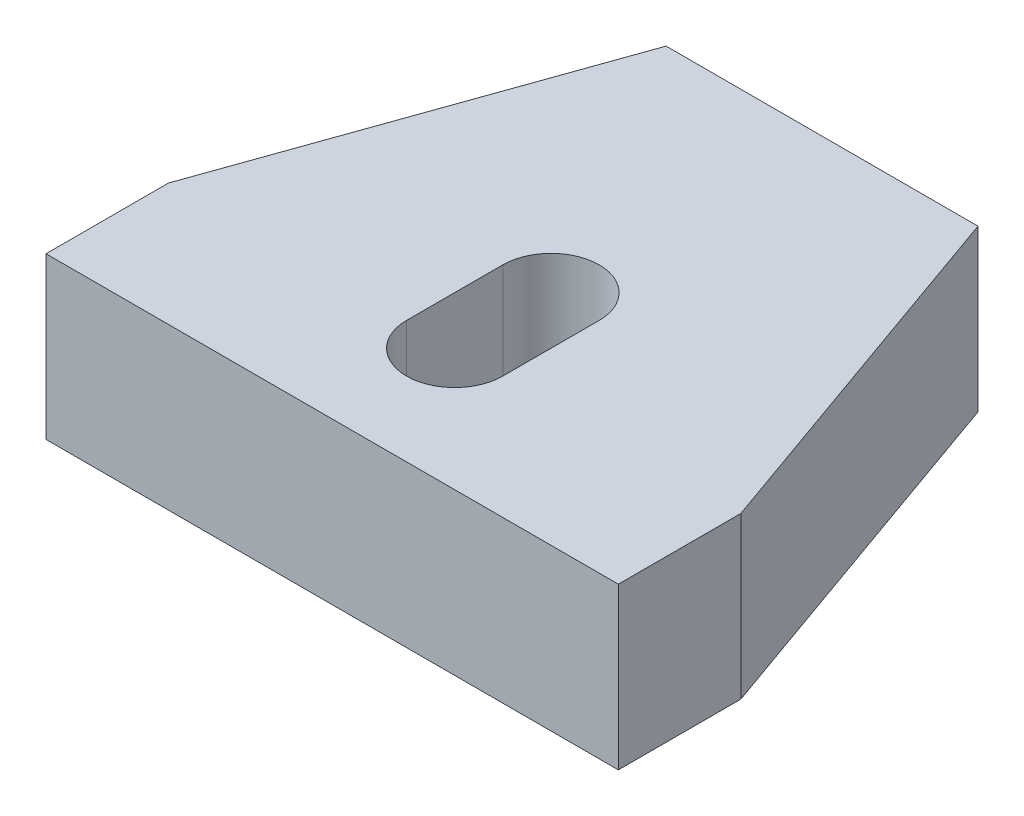
ISO-10303-21;
HEADER;
FILE_DESCRIPTION(('STEP AP214'),'2;1');
FILE_NAME('part.step','',(''),(''),'','','');
FILE_SCHEMA(('AUTOMOTIVE_DESIGN { 1 0 10303 214 1 1 1 1 }'));
ENDSEC;
DATA;
#1=APPLICATION_CONTEXT('core data for automotive mechanical design processes');
#2=APPLICATION_PROTOCOL_DEFINITION('international standard','automotive_design',2000,#1);
#3=PRODUCT_CONTEXT('',#1,'mechanical');
#4=PRODUCT('Part','Part','',(#3));
#5=PRODUCT_RELATED_PRODUCT_CATEGORY('part','',(#4));
#6=PRODUCT_DEFINITION_FORMATION('','',#4);
#7=PRODUCT_DEFINITION_CONTEXT('part definition',#1,'design');
#8=PRODUCT_DEFINITION('design','',#6,#7);
#9=PRODUCT_DEFINITION_SHAPE('','',#8);
#10=(LENGTH_UNIT() NAMED_UNIT(*) SI_UNIT(.MILLI.,.METRE.));
#11=(NAMED_UNIT(*) PLANE_ANGLE_UNIT() SI_UNIT($,.RADIAN.));
#12=(NAMED_UNIT(*) SI_UNIT($,.STERADIAN.) SOLID_ANGLE_UNIT());
#13=UNCERTAINTY_MEASURE_WITH_UNIT(LENGTH_MEASURE(1.E-05),#10,'distance_accuracy_value','');
#14=(GEOMETRIC_REPRESENTATION_CONTEXT(3) GLOBAL_UNCERTAINTY_ASSIGNED_CONTEXT((#13)) GLOBAL_UNIT_ASSIGNED_CONTEXT((#10,
#11,#12)) REPRESENTATION_CONTEXT('',''));
#15=CARTESIAN_POINT('',(0.,0.,0.));
#16=DIRECTION('',(0.,0.,1.));
#17=DIRECTION('',(1.,0.,0.));
#18=AXIS2_PLACEMENT_3D('',#15,#16,#17);
#19=CARTESIAN_POINT('',(0.,5.0038,0.));
#20=DIRECTION('',(0.,1.,0.));
#21=DIRECTION('',(0.,0.,1.));
#22=AXIS2_PLACEMENT_3D('',#19,#20,#21);
#23=PLANE('',#22);
#24=DIRECTION('',(-0.334079769437549,0.,0.942544804055783));
#25=VECTOR('',#24,1.);
#26=CARTESIAN_POINT('',(-4.8514,5.0038,-15.24));
#27=LINE('',#26,#25);
#28=CARTESIAN_POINT('',(-4.8514,5.0038,-15.24));
#29=VERTEX_POINT('',#28);
#30=CARTESIAN_POINT('',(-8.9027,5.0038,-3.81));
#31=VERTEX_POINT('',#30);
#32=EDGE_CURVE('E145',#29,#31,#27,.T.);
#33=ORIENTED_EDGE('',*,*,#32,.T.);
#34=DIRECTION('',(0.,0.,1.));
#35=VECTOR('',#34,1.);
#36=CARTESIAN_POINT('',(-8.9027,5.0038,0.));
#37=LINE('',#36,#35);
#38=CARTESIAN_POINT('',(-8.9027,5.0038,0.));
#39=VERTEX_POINT('',#38);
#40=EDGE_CURVE('E148',#31,#39,#37,.T.);
#41=ORIENTED_EDGE('',*,*,#40,.T.);
#42=DIRECTION('',(1.,0.,0.));
#43=VECTOR('',#42,1.);
#44=CARTESIAN_POINT('',(-8.9027,5.0038,0.));
#45=LINE('',#44,#43);
#46=CARTESIAN_POINT('',(8.9027,5.0038,0.));
#47=VERTEX_POINT('',#46);
#48=EDGE_CURVE('E151',#39,#47,#45,.T.);
#49=ORIENTED_EDGE('',*,*,#48,.T.);
#50=DIRECTION('',(0.,0.,-1.));
#51=VECTOR('',#50,1.);
#52=CARTESIAN_POINT('',(8.9027,5.0038,0.));
#53=LINE('',#52,#51);
#54=CARTESIAN_POINT('',(8.9027,5.0038,-3.81));
#55=VERTEX_POINT('',#54);
#56=EDGE_CURVE('E153',#47,#55,#53,.T.);
#57=ORIENTED_EDGE('',*,*,#56,.T.);
#58=DIRECTION('',(-0.33407976943755,0.,-0.942544804055783));
#59=VECTOR('',#58,1.);
#60=CARTESIAN_POINT('',(8.9027,5.0038,-3.81));
#61=LINE('',#60,#59);
#62=CARTESIAN_POINT('',(4.8514,5.0038,-15.24));
#63=VERTEX_POINT('',#62);
#64=EDGE_CURVE('E155',#55,#63,#61,.T.);
#65=ORIENTED_EDGE('',*,*,#64,.T.);
#66=DIRECTION('',(-1.,0.,0.));
#67=VECTOR('',#66,1.);
#68=CARTESIAN_POINT('',(-4.8514,5.0038,-15.24));
#69=LINE('',#68,#67);
#70=EDGE_CURVE('E157',#63,#29,#69,.T.);
#71=ORIENTED_EDGE('',*,*,#70,.T.);
#72=EDGE_LOOP('',(#33,#41,#49,#57,#65,#71));
#73=FACE_BOUND('',#72,.T.);
#74=DIRECTION('',(0.,0.,-1.));
#75=VECTOR('',#74,1.);
#76=CARTESIAN_POINT('',(1.4986,5.0038,-3.81));
#77=LINE('',#76,#75);
#78=CARTESIAN_POINT('',(1.4986,5.0038,-3.81));
#79=VERTEX_POINT('',#78);
#80=CARTESIAN_POINT('',(1.4986,5.0038,-6.8072));
#81=VERTEX_POINT('',#80);
#82=EDGE_CURVE('E117',#79,#81,#77,.T.);
#83=ORIENTED_EDGE('',*,*,#82,.F.);
#84=CARTESIAN_POINT('',(0.,5.0038,-3.81));
#85=DIRECTION('',(0.,1.,0.));
#86=DIRECTION('',(0.,0.,1.));
#87=AXIS2_PLACEMENT_3D('',#84,#85,#86);
#88=CIRCLE('',#87,1.4986);
#89=CARTESIAN_POINT('',(-1.4986,5.0038,-3.81));
#90=VERTEX_POINT('',#89);
#91=EDGE_CURVE('E109',#90,#79,#88,.T.);
#92=ORIENTED_EDGE('',*,*,#91,.F.);
#93=DIRECTION('',(0.,0.,1.));
#94=VECTOR('',#93,1.);
#95=CARTESIAN_POINT('',(-1.4986,5.0038,-3.81));
#96=LINE('',#95,#94);
#97=CARTESIAN_POINT('',(-1.4986,5.0038,-6.8072));
#98=VERTEX_POINT('',#97);
#99=EDGE_CURVE('E131',#98,#90,#96,.T.);
#100=ORIENTED_EDGE('',*,*,#99,.F.);
#101=CARTESIAN_POINT('',(0.,5.0038,-6.8072));
#102=DIRECTION('',(0.,1.,0.));
#103=DIRECTION('',(0.,0.,1.));
#104=AXIS2_PLACEMENT_3D('',#101,#102,#103);
#105=CIRCLE('',#104,1.4986);
#106=EDGE_CURVE('E129',#81,#98,#105,.T.);
#107=ORIENTED_EDGE('',*,*,#106,.F.);
#108=EDGE_LOOP('',(#83,#92,#100,#107));
#109=FACE_BOUND('',#108,.T.);
#110=ADVANCED_FACE('F32',(#73,#109),#23,.T.);
#111=CARTESIAN_POINT('',(0.,0.,0.));
#112=DIRECTION('',(0.,1.,0.));
#113=DIRECTION('',(0.,0.,1.));
#114=AXIS2_PLACEMENT_3D('',#111,#112,#113);
#115=PLANE('',#114);
#116=DIRECTION('',(-0.334079769437549,0.,0.942544804055783));
#117=VECTOR('',#116,1.);
#118=CARTESIAN_POINT('',(-4.8514,0.,-15.24));
#119=LINE('',#118,#117);
#120=CARTESIAN_POINT('',(-4.8514,0.,-15.24));
#121=VERTEX_POINT('',#120);
#122=CARTESIAN_POINT('',(-8.9027,0.,-3.81));
#123=VERTEX_POINT('',#122);
#124=EDGE_CURVE('E125',#121,#123,#119,.T.);
#125=ORIENTED_EDGE('',*,*,#124,.F.);
#126=DIRECTION('',(-1.,0.,0.));
#127=VECTOR('',#126,1.);
#128=CARTESIAN_POINT('',(-4.8514,0.,-15.24));
#129=LINE('',#128,#127);
#130=CARTESIAN_POINT('',(4.8514,0.,-15.24));
#131=VERTEX_POINT('',#130);
#132=EDGE_CURVE('E149',#131,#121,#129,.T.);
#133=ORIENTED_EDGE('',*,*,#132,.F.);
#134=DIRECTION('',(-0.33407976943755,0.,-0.942544804055783));
#135=VECTOR('',#134,1.);
#136=CARTESIAN_POINT('',(8.9027,0.,-3.81));
#137=LINE('',#136,#135);
#138=CARTESIAN_POINT('',(8.9027,0.,-3.81));
#139=VERTEX_POINT('',#138);
#140=EDGE_CURVE('E168',#139,#131,#137,.T.);
#141=ORIENTED_EDGE('',*,*,#140,.F.);
#142=DIRECTION('',(0.,0.,-1.));
#143=VECTOR('',#142,1.);
#144=CARTESIAN_POINT('',(8.9027,0.,0.));
#145=LINE('',#144,#143);
#146=CARTESIAN_POINT('',(8.9027,0.,0.));
#147=VERTEX_POINT('',#146);
#148=EDGE_CURVE('E166',#147,#139,#145,.T.);
#149=ORIENTED_EDGE('',*,*,#148,.F.);
#150=DIRECTION('',(1.,0.,0.));
#151=VECTOR('',#150,1.);
#152=CARTESIAN_POINT('',(-8.9027,0.,0.));
#153=LINE('',#152,#151);
#154=CARTESIAN_POINT('',(-8.9027,0.,0.));
#155=VERTEX_POINT('',#154);
#156=EDGE_CURVE('E164',#155,#147,#153,.T.);
#157=ORIENTED_EDGE('',*,*,#156,.F.);
#158=DIRECTION('',(0.,0.,1.));
#159=VECTOR('',#158,1.);
#160=CARTESIAN_POINT('',(-8.9027,0.,0.));
#161=LINE('',#160,#159);
#162=EDGE_CURVE('E162',#123,#155,#161,.T.);
#163=ORIENTED_EDGE('',*,*,#162,.F.);
#164=EDGE_LOOP('',(#125,#133,#141,#149,#157,#163));
#165=FACE_BOUND('',#164,.T.);
#166=CARTESIAN_POINT('',(0.,0.,-3.81));
#167=DIRECTION('',(0.,1.,0.));
#168=DIRECTION('',(0.,0.,1.));
#169=AXIS2_PLACEMENT_3D('',#166,#167,#168);
#170=CIRCLE('',#169,1.4986);
#171=CARTESIAN_POINT('',(-1.4986,0.,-3.81));
#172=VERTEX_POINT('',#171);
#173=CARTESIAN_POINT('',(1.4986,0.,-3.81));
#174=VERTEX_POINT('',#173);
#175=EDGE_CURVE('E55',#172,#174,#170,.T.);
#176=ORIENTED_EDGE('',*,*,#175,.T.);
#177=DIRECTION('',(0.,0.,-1.));
#178=VECTOR('',#177,1.);
#179=CARTESIAN_POINT('',(1.4986,0.,-3.81));
#180=LINE('',#179,#178);
#181=CARTESIAN_POINT('',(1.4986,0.,-6.8072));
#182=VERTEX_POINT('',#181);
#183=EDGE_CURVE('E124',#174,#182,#180,.T.);
#184=ORIENTED_EDGE('',*,*,#183,.T.);
#185=CARTESIAN_POINT('',(0.,0.,-6.8072));
#186=DIRECTION('',(0.,1.,0.));
#187=DIRECTION('',(0.,0.,1.));
#188=AXIS2_PLACEMENT_3D('',#185,#186,#187);
#189=CIRCLE('',#188,1.4986);
#190=CARTESIAN_POINT('',(-1.4986,0.,-6.8072));
#191=VERTEX_POINT('',#190);
#192=EDGE_CURVE('E137',#182,#191,#189,.T.);
#193=ORIENTED_EDGE('',*,*,#192,.T.);
#194=DIRECTION('',(0.,0.,1.));
#195=VECTOR('',#194,1.);
#196=CARTESIAN_POINT('',(-1.4986,0.,-3.81));
#197=LINE('',#196,#195);
#198=EDGE_CURVE('E118',#191,#172,#197,.T.);
#199=ORIENTED_EDGE('',*,*,#198,.T.);
#200=EDGE_LOOP('',(#176,#184,#193,#199));
#201=FACE_BOUND('',#200,.T.);
#202=ADVANCED_FACE('F192',(#165,#201),#115,.F.);
#203=CARTESIAN_POINT('',(-4.8514,5.0038,-15.24));
#204=DIRECTION('',(0.942544804055783,0.,0.334079769437549));
#205=DIRECTION('',(0.334079769437549,0.,-0.942544804055783));
#206=AXIS2_PLACEMENT_3D('',#203,#204,#205);
#207=PLANE('',#206);
#208=ORIENTED_EDGE('',*,*,#124,.T.);
#209=DIRECTION('',(0.,-1.,0.));
#210=VECTOR('',#209,1.);
#211=CARTESIAN_POINT('',(-8.9027,5.0038,-3.81));
#212=LINE('',#211,#210);
#213=EDGE_CURVE('E11',#31,#123,#212,.T.);
#214=ORIENTED_EDGE('',*,*,#213,.F.);
#215=ORIENTED_EDGE('',*,*,#32,.F.);
#216=DIRECTION('',(0.,-1.,0.));
#217=VECTOR('',#216,1.);
#218=CARTESIAN_POINT('',(-4.8514,5.0038,-15.24));
#219=LINE('',#218,#217);
#220=EDGE_CURVE('E159',#29,#121,#219,.T.);
#221=ORIENTED_EDGE('',*,*,#220,.T.);
#222=EDGE_LOOP('',(#208,#214,#215,#221));
#223=FACE_BOUND('',#222,.T.);
#224=ADVANCED_FACE('F34',(#223),#207,.F.);
#225=CARTESIAN_POINT('',(-8.9027,5.0038,0.));
#226=DIRECTION('',(1.,0.,0.));
#227=DIRECTION('',(0.,0.,-1.));
#228=AXIS2_PLACEMENT_3D('',#225,#226,#227);
#229=PLANE('',#228);
#230=ORIENTED_EDGE('',*,*,#162,.T.);
#231=DIRECTION('',(0.,-1.,0.));
#232=VECTOR('',#231,1.);
#233=CARTESIAN_POINT('',(-8.9027,5.0038,0.));
#234=LINE('',#233,#232);
#235=EDGE_CURVE('E40',#39,#155,#234,.T.);
#236=ORIENTED_EDGE('',*,*,#235,.F.);
#237=ORIENTED_EDGE('',*,*,#40,.F.);
#238=ORIENTED_EDGE('',*,*,#213,.T.);
#239=EDGE_LOOP('',(#230,#236,#237,#238));
#240=FACE_BOUND('',#239,.T.);
#241=ADVANCED_FACE('F209',(#240),#229,.F.);
#242=CARTESIAN_POINT('',(-8.9027,5.0038,0.));
#243=DIRECTION('',(0.,0.,-1.));
#244=DIRECTION('',(-1.,0.,0.));
#245=AXIS2_PLACEMENT_3D('',#242,#243,#244);
#246=PLANE('',#245);
#247=ORIENTED_EDGE('',*,*,#156,.T.);
#248=DIRECTION('',(0.,-1.,0.));
#249=VECTOR('',#248,1.);
#250=CARTESIAN_POINT('',(8.9027,5.0038,0.));
#251=LINE('',#250,#249);
#252=EDGE_CURVE('E179',#47,#147,#251,.T.);
#253=ORIENTED_EDGE('',*,*,#252,.F.);
#254=ORIENTED_EDGE('',*,*,#48,.F.);
#255=ORIENTED_EDGE('',*,*,#235,.T.);
#256=EDGE_LOOP('',(#247,#253,#254,#255));
#257=FACE_BOUND('',#256,.T.);
#258=ADVANCED_FACE('F186',(#257),#246,.F.);
#259=CARTESIAN_POINT('',(8.9027,5.0038,0.));
#260=DIRECTION('',(-1.,0.,0.));
#261=DIRECTION('',(0.,0.,1.));
#262=AXIS2_PLACEMENT_3D('',#259,#260,#261);
#263=PLANE('',#262);
#264=ORIENTED_EDGE('',*,*,#148,.T.);
#265=DIRECTION('',(0.,-1.,0.));
#266=VECTOR('',#265,1.);
#267=CARTESIAN_POINT('',(8.9027,5.0038,-3.81));
#268=LINE('',#267,#266);
#269=EDGE_CURVE('E176',#55,#139,#268,.T.);
#270=ORIENTED_EDGE('',*,*,#269,.F.);
#271=ORIENTED_EDGE('',*,*,#56,.F.);
#272=ORIENTED_EDGE('',*,*,#252,.T.);
#273=EDGE_LOOP('',(#264,#270,#271,#272));
#274=FACE_BOUND('',#273,.T.);
#275=ADVANCED_FACE('F198',(#274),#263,.F.);
#276=CARTESIAN_POINT('',(8.9027,5.0038,-3.81));
#277=DIRECTION('',(-0.942544804055783,0.,0.33407976943755));
#278=DIRECTION('',(0.33407976943755,0.,0.942544804055783));
#279=AXIS2_PLACEMENT_3D('',#276,#277,#278);
#280=PLANE('',#279);
#281=ORIENTED_EDGE('',*,*,#140,.T.);
#282=DIRECTION('',(0.,-1.,0.));
#283=VECTOR('',#282,1.);
#284=CARTESIAN_POINT('',(4.8514,5.0038,-15.24));
#285=LINE('',#284,#283);
#286=EDGE_CURVE('E173',#63,#131,#285,.T.);
#287=ORIENTED_EDGE('',*,*,#286,.F.);
#288=ORIENTED_EDGE('',*,*,#64,.F.);
#289=ORIENTED_EDGE('',*,*,#269,.T.);
#290=EDGE_LOOP('',(#281,#287,#288,#289));
#291=FACE_BOUND('',#290,.T.);
#292=ADVANCED_FACE('F202',(#291),#280,.F.);
#293=CARTESIAN_POINT('',(-4.8514,5.0038,-15.24));
#294=DIRECTION('',(0.,0.,1.));
#295=DIRECTION('',(1.,0.,0.));
#296=AXIS2_PLACEMENT_3D('',#293,#294,#295);
#297=PLANE('',#296);
#298=ORIENTED_EDGE('',*,*,#132,.T.);
#299=ORIENTED_EDGE('',*,*,#220,.F.);
#300=ORIENTED_EDGE('',*,*,#70,.F.);
#301=ORIENTED_EDGE('',*,*,#286,.T.);
#302=EDGE_LOOP('',(#298,#299,#300,#301));
#303=FACE_BOUND('',#302,.T.);
#304=ADVANCED_FACE('F212',(#303),#297,.F.);
#305=CARTESIAN_POINT('',(0.,5.0038,-3.81));
#306=DIRECTION('',(0.,-1.,0.));
#307=DIRECTION('',(0.,0.,-1.));
#308=AXIS2_PLACEMENT_3D('',#305,#306,#307);
#309=CYLINDRICAL_SURFACE('',#308,1.4986);
#310=ORIENTED_EDGE('',*,*,#175,.F.);
#311=DIRECTION('',(0.,-1.,0.));
#312=VECTOR('',#311,1.);
#313=CARTESIAN_POINT('',(-1.4986,5.0038,-3.81));
#314=LINE('',#313,#312);
#315=EDGE_CURVE('E113',#90,#172,#314,.T.);
#316=ORIENTED_EDGE('',*,*,#315,.F.);
#317=ORIENTED_EDGE('',*,*,#91,.T.);
#318=DIRECTION('',(0.,-1.,0.));
#319=VECTOR('',#318,1.);
#320=CARTESIAN_POINT('',(1.4986,5.0038,-3.81));
#321=LINE('',#320,#319);
#322=EDGE_CURVE('E112',#79,#174,#321,.T.);
#323=ORIENTED_EDGE('',*,*,#322,.T.);
#324=EDGE_LOOP('',(#310,#316,#317,#323));
#325=FACE_BOUND('',#324,.T.);
#326=ADVANCED_FACE('F111',(#325),#309,.F.);
#327=CARTESIAN_POINT('',(1.4986,5.0038,-3.81));
#328=DIRECTION('',(-1.,0.,0.));
#329=DIRECTION('',(0.,0.,1.));
#330=AXIS2_PLACEMENT_3D('',#327,#328,#329);
#331=PLANE('',#330);
#332=ORIENTED_EDGE('',*,*,#183,.F.);
#333=ORIENTED_EDGE('',*,*,#322,.F.);
#334=ORIENTED_EDGE('',*,*,#82,.T.);
#335=DIRECTION('',(0.,-1.,0.));
#336=VECTOR('',#335,1.);
#337=CARTESIAN_POINT('',(1.4986,5.0038,-6.8072));
#338=LINE('',#337,#336);
#339=EDGE_CURVE('E126',#81,#182,#338,.T.);
#340=ORIENTED_EDGE('',*,*,#339,.T.);
#341=EDGE_LOOP('',(#332,#333,#334,#340));
#342=FACE_BOUND('',#341,.T.);
#343=ADVANCED_FACE('F121',(#342),#331,.T.);
#344=CARTESIAN_POINT('',(0.,5.0038,-6.8072));
#345=DIRECTION('',(0.,-1.,0.));
#346=DIRECTION('',(0.,0.,-1.));
#347=AXIS2_PLACEMENT_3D('',#344,#345,#346);
#348=CYLINDRICAL_SURFACE('',#347,1.4986);
#349=ORIENTED_EDGE('',*,*,#192,.F.);
#350=ORIENTED_EDGE('',*,*,#339,.F.);
#351=ORIENTED_EDGE('',*,*,#106,.T.);
#352=DIRECTION('',(0.,-1.,0.));
#353=VECTOR('',#352,1.);
#354=CARTESIAN_POINT('',(-1.4986,5.0038,-6.8072));
#355=LINE('',#354,#353);
#356=EDGE_CURVE('E47',#98,#191,#355,.T.);
#357=ORIENTED_EDGE('',*,*,#356,.T.);
#358=EDGE_LOOP('',(#349,#350,#351,#357));
#359=FACE_BOUND('',#358,.T.);
#360=ADVANCED_FACE('F230',(#359),#348,.F.);
#361=CARTESIAN_POINT('',(-1.4986,5.0038,-3.81));
#362=DIRECTION('',(1.,0.,0.));
#363=DIRECTION('',(0.,0.,-1.));
#364=AXIS2_PLACEMENT_3D('',#361,#362,#363);
#365=PLANE('',#364);
#366=ORIENTED_EDGE('',*,*,#198,.F.);
#367=ORIENTED_EDGE('',*,*,#356,.F.);
#368=ORIENTED_EDGE('',*,*,#99,.T.);
#369=ORIENTED_EDGE('',*,*,#315,.T.);
#370=EDGE_LOOP('',(#366,#367,#368,#369));
#371=FACE_BOUND('',#370,.T.);
#372=ADVANCED_FACE('F233',(#371),#365,.T.);
#373=CLOSED_SHELL('',(#110,#202,#224,#241,#258,#275,#292,#304,#326,#343,#360,#372));
#374=MANIFOLD_SOLID_BREP('B2',#373);
#375=ADVANCED_BREP_SHAPE_REPRESENTATION('',(#18,#374),#14);
#376=SHAPE_DEFINITION_REPRESENTATION(#9,#375);
ENDSEC;
END-ISO-10303-21;
